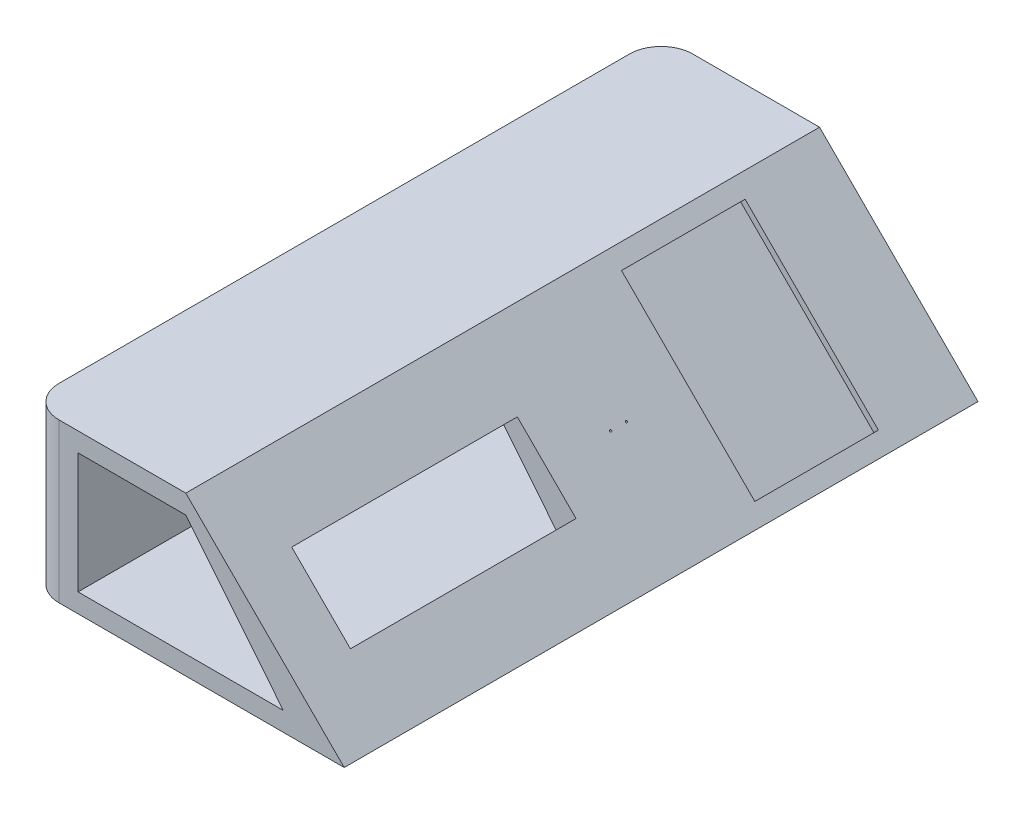
ISO-10303-21;
HEADER;
FILE_DESCRIPTION(('STEP AP214'),'2;1');
FILE_NAME('part.step','',(''),(''),'','','');
FILE_SCHEMA(('AUTOMOTIVE_DESIGN { 1 0 10303 214 1 1 1 1 }'));
ENDSEC;
DATA;
#1=APPLICATION_CONTEXT('core data for automotive mechanical design processes');
#2=APPLICATION_PROTOCOL_DEFINITION('international standard','automotive_design',2000,#1);
#3=PRODUCT_CONTEXT('',#1,'mechanical');
#4=PRODUCT('Part','Part','',(#3));
#5=PRODUCT_RELATED_PRODUCT_CATEGORY('part','',(#4));
#6=PRODUCT_DEFINITION_FORMATION('','',#4);
#7=PRODUCT_DEFINITION_CONTEXT('part definition',#1,'design');
#8=PRODUCT_DEFINITION('design','',#6,#7);
#9=PRODUCT_DEFINITION_SHAPE('','',#8);
#10=(LENGTH_UNIT() NAMED_UNIT(*) SI_UNIT(.MILLI.,.METRE.));
#11=(NAMED_UNIT(*) PLANE_ANGLE_UNIT() SI_UNIT($,.RADIAN.));
#12=(NAMED_UNIT(*) SI_UNIT($,.STERADIAN.) SOLID_ANGLE_UNIT());
#13=UNCERTAINTY_MEASURE_WITH_UNIT(LENGTH_MEASURE(1.E-05),#10,'distance_accuracy_value','');
#14=(GEOMETRIC_REPRESENTATION_CONTEXT(3) GLOBAL_UNCERTAINTY_ASSIGNED_CONTEXT((#13)) GLOBAL_UNIT_ASSIGNED_CONTEXT((#10,
#11,#12)) REPRESENTATION_CONTEXT('',''));
#15=CARTESIAN_POINT('',(0.,0.,0.));
#16=DIRECTION('',(0.,0.,1.));
#17=DIRECTION('',(1.,0.,0.));
#18=AXIS2_PLACEMENT_3D('',#15,#16,#17);
#19=CARTESIAN_POINT('',(0.,0.,200.));
#20=DIRECTION('',(1.,0.,0.));
#21=DIRECTION('',(0.,0.,-1.));
#22=AXIS2_PLACEMENT_3D('',#19,#20,#21);
#23=PLANE('',#22);
#24=DIRECTION('',(0.,0.,-1.));
#25=VECTOR('',#24,1.);
#26=CARTESIAN_POINT('',(0.,50.0000000000002,200.));
#27=LINE('',#26,#25);
#28=CARTESIAN_POINT('',(0.,50.0000000000002,190.));
#29=VERTEX_POINT('',#28);
#30=CARTESIAN_POINT('',(0.,50.0000000000002,10.));
#31=VERTEX_POINT('',#30);
#32=EDGE_CURVE('E307',#29,#31,#27,.T.);
#33=ORIENTED_EDGE('',*,*,#32,.T.);
#34=DIRECTION('',(0.,-1.,0.));
#35=VECTOR('',#34,1.);
#36=CARTESIAN_POINT('',(0.,0.,10.));
#37=LINE('',#36,#35);
#38=CARTESIAN_POINT('',(0.,0.,10.));
#39=VERTEX_POINT('',#38);
#40=EDGE_CURVE('E334',#31,#39,#37,.T.);
#41=ORIENTED_EDGE('',*,*,#40,.T.);
#42=DIRECTION('',(0.,0.,-1.));
#43=VECTOR('',#42,1.);
#44=CARTESIAN_POINT('',(0.,0.,200.));
#45=LINE('',#44,#43);
#46=CARTESIAN_POINT('',(0.,0.,190.));
#47=VERTEX_POINT('',#46);
#48=EDGE_CURVE('E327',#47,#39,#45,.T.);
#49=ORIENTED_EDGE('',*,*,#48,.F.);
#50=DIRECTION('',(0.,-1.,0.));
#51=VECTOR('',#50,1.);
#52=CARTESIAN_POINT('',(0.,0.,190.));
#53=LINE('',#52,#51);
#54=EDGE_CURVE('E331',#47,#29,#53,.F.);
#55=ORIENTED_EDGE('',*,*,#54,.T.);
#56=EDGE_LOOP('',(#33,#41,#49,#55));
#57=FACE_BOUND('',#56,.T.);
#58=ADVANCED_FACE('F48',(#57),#23,.F.);
#59=CARTESIAN_POINT('',(0.,0.,200.));
#60=DIRECTION('',(0.,1.,0.));
#61=DIRECTION('',(0.,0.,1.));
#62=AXIS2_PLACEMENT_3D('',#59,#60,#61);
#63=PLANE('',#62);
#64=ORIENTED_EDGE('',*,*,#48,.T.);
#65=CARTESIAN_POINT('',(10.,0.,10.));
#66=DIRECTION('',(0.,1.,0.));
#67=DIRECTION('',(0.,0.,1.));
#68=AXIS2_PLACEMENT_3D('',#65,#66,#67);
#69=CIRCLE('',#68,10.);
#70=CARTESIAN_POINT('',(10.,0.,0.));
#71=VERTEX_POINT('',#70);
#72=EDGE_CURVE('E341',#39,#71,#69,.F.);
#73=ORIENTED_EDGE('',*,*,#72,.T.);
#74=DIRECTION('',(1.,0.,0.));
#75=VECTOR('',#74,1.);
#76=CARTESIAN_POINT('',(0.,0.,0.));
#77=LINE('',#76,#75);
#78=CARTESIAN_POINT('',(100.,0.,0.));
#79=VERTEX_POINT('',#78);
#80=EDGE_CURVE('E286',#71,#79,#77,.T.);
#81=ORIENTED_EDGE('',*,*,#80,.T.);
#82=DIRECTION('',(0.,0.,-1.));
#83=VECTOR('',#82,1.);
#84=CARTESIAN_POINT('',(100.,0.,200.));
#85=LINE('',#84,#83);
#86=CARTESIAN_POINT('',(100.,0.,200.));
#87=VERTEX_POINT('',#86);
#88=EDGE_CURVE('E323',#87,#79,#85,.T.);
#89=ORIENTED_EDGE('',*,*,#88,.F.);
#90=DIRECTION('',(1.,0.,0.));
#91=VECTOR('',#90,1.);
#92=CARTESIAN_POINT('',(0.,0.,200.));
#93=LINE('',#92,#91);
#94=CARTESIAN_POINT('',(10.,0.,200.));
#95=VERTEX_POINT('',#94);
#96=EDGE_CURVE('E296',#95,#87,#93,.T.);
#97=ORIENTED_EDGE('',*,*,#96,.F.);
#98=CARTESIAN_POINT('',(10.,0.,190.));
#99=DIRECTION('',(0.,1.,0.));
#100=DIRECTION('',(0.,0.,1.));
#101=AXIS2_PLACEMENT_3D('',#98,#99,#100);
#102=CIRCLE('',#101,10.);
#103=EDGE_CURVE('E338',#95,#47,#102,.F.);
#104=ORIENTED_EDGE('',*,*,#103,.T.);
#105=EDGE_LOOP('',(#64,#73,#81,#89,#97,#104));
#106=FACE_BOUND('',#105,.T.);
#107=ADVANCED_FACE('F507',(#106),#63,.F.);
#108=CARTESIAN_POINT('',(50.,50.0000000000002,200.));
#109=DIRECTION('',(-0.707106781186549,-0.707106781186546,0.));
#110=DIRECTION('',(0.707106781186546,-0.707106781186549,0.));
#111=AXIS2_PLACEMENT_3D('',#108,#109,#110);
#112=PLANE('',#111);
#113=CARTESIAN_POINT('',(75.,25.0000000000001,90.9366552980361));
#114=DIRECTION('',(0.707106781186549,0.707106781186546,0.));
#115=DIRECTION('',(-0.707106781186546,0.707106781186549,0.));
#116=AXIS2_PLACEMENT_3D('',#113,#114,#115);
#117=CIRCLE('',#116,0.299999999999999);
#118=CARTESIAN_POINT('',(74.7878679656441,25.2121320343561,90.9366552980361));
#119=VERTEX_POINT('',#118);
#120=EDGE_CURVE('E368',#119,#119,#117,.T.);
#121=ORIENTED_EDGE('',*,*,#120,.F.);
#122=EDGE_LOOP('',(#121));
#123=FACE_BOUND('',#122,.T.);
#124=CARTESIAN_POINT('',(75.,25.0000000000001,85.9366552980361));
#125=DIRECTION('',(0.707106781186549,0.707106781186546,0.));
#126=DIRECTION('',(0.707106781186546,-0.707106781186549,0.));
#127=AXIS2_PLACEMENT_3D('',#124,#125,#126);
#128=CIRCLE('',#127,0.299999999999999);
#129=CARTESIAN_POINT('',(75.212132034356,24.7878679656441,85.9366552980361));
#130=VERTEX_POINT('',#129);
#131=EDGE_CURVE('E376',#130,#130,#128,.T.);
#132=ORIENTED_EDGE('',*,*,#131,.F.);
#133=EDGE_LOOP('',(#132));
#134=FACE_BOUND('',#133,.T.);
#135=DIRECTION('',(0.,0.,1.));
#136=VECTOR('',#135,1.);
#137=CARTESIAN_POINT('',(65.7369011664563,34.2630988335439,182.311084233199));
#138=LINE('',#137,#136);
#139=CARTESIAN_POINT('',(65.7369011664563,34.2630988335439,111.111084233199));
#140=VERTEX_POINT('',#139);
#141=CARTESIAN_POINT('',(65.7369011664563,34.2630988335439,182.311084233199));
#142=VERTEX_POINT('',#141);
#143=EDGE_CURVE('E229',#140,#142,#138,.T.);
#144=ORIENTED_EDGE('',*,*,#143,.F.);
#145=DIRECTION('',(-0.707106781186546,0.707106781186549,0.));
#146=VECTOR('',#145,1.);
#147=CARTESIAN_POINT('',(65.7369011664563,34.2630988335439,111.111084233199));
#148=LINE('',#147,#146);
#149=CARTESIAN_POINT('',(84.2630988335438,15.7369011664563,111.111084233199));
#150=VERTEX_POINT('',#149);
#151=EDGE_CURVE('E225',#150,#140,#148,.T.);
#152=ORIENTED_EDGE('',*,*,#151,.F.);
#153=DIRECTION('',(0.,0.,-1.));
#154=VECTOR('',#153,1.);
#155=CARTESIAN_POINT('',(84.2630988335438,15.7369011664563,182.311084233199));
#156=LINE('',#155,#154);
#157=CARTESIAN_POINT('',(84.2630988335438,15.7369011664563,182.311084233199));
#158=VERTEX_POINT('',#157);
#159=EDGE_CURVE('E237',#158,#150,#156,.T.);
#160=ORIENTED_EDGE('',*,*,#159,.F.);
#161=DIRECTION('',(0.707106781186546,-0.707106781186549,0.));
#162=VECTOR('',#161,1.);
#163=CARTESIAN_POINT('',(65.7369011664563,34.2630988335439,182.311084233199));
#164=LINE('',#163,#162);
#165=EDGE_CURVE('E233',#142,#158,#164,.T.);
#166=ORIENTED_EDGE('',*,*,#165,.F.);
#167=EDGE_LOOP('',(#144,#152,#160,#166));
#168=FACE_BOUND('',#167,.T.);
#169=DIRECTION('',(0.,0.,-1.));
#170=VECTOR('',#169,1.);
#171=CARTESIAN_POINT('',(96.0364267402998,3.96357325970027,66.4622855669242));
#172=LINE('',#171,#170);
#173=CARTESIAN_POINT('',(96.0364267402998,3.96357325970025,66.4622855669242));
#174=VERTEX_POINT('',#173);
#175=CARTESIAN_POINT('',(96.0364267402998,3.96357325970027,27.4622855669242));
#176=VERTEX_POINT('',#175);
#177=EDGE_CURVE('E272',#174,#176,#172,.T.);
#178=ORIENTED_EDGE('',*,*,#177,.F.);
#179=DIRECTION('',(0.707106781186546,-0.707106781186549,0.));
#180=VECTOR('',#179,1.);
#181=CARTESIAN_POINT('',(53.9635732597003,46.0364267402999,66.4622855669242));
#182=LINE('',#181,#180);
#183=CARTESIAN_POINT('',(53.9635732597003,46.0364267402999,66.4622855669242));
#184=VERTEX_POINT('',#183);
#185=EDGE_CURVE('E245',#184,#174,#182,.T.);
#186=ORIENTED_EDGE('',*,*,#185,.F.);
#187=DIRECTION('',(0.,0.,-1.));
#188=VECTOR('',#187,1.);
#189=CARTESIAN_POINT('',(53.9635732597003,46.0364267402999,66.4622855669242));
#190=LINE('',#189,#188);
#191=CARTESIAN_POINT('',(53.9635732597003,46.0364267402999,27.4622855669242));
#192=VERTEX_POINT('',#191);
#193=EDGE_CURVE('E259',#184,#192,#190,.T.);
#194=ORIENTED_EDGE('',*,*,#193,.T.);
#195=DIRECTION('',(0.707106781186546,-0.707106781186549,0.));
#196=VECTOR('',#195,1.);
#197=CARTESIAN_POINT('',(53.9635732597003,46.0364267402999,27.4622855669242));
#198=LINE('',#197,#196);
#199=EDGE_CURVE('E276',#192,#176,#198,.T.);
#200=ORIENTED_EDGE('',*,*,#199,.T.);
#201=EDGE_LOOP('',(#178,#186,#194,#200));
#202=FACE_BOUND('',#201,.T.);
#203=DIRECTION('',(-0.707106781186546,0.707106781186549,0.));
#204=VECTOR('',#203,1.);
#205=CARTESIAN_POINT('',(50.,50.0000000000002,0.));
#206=LINE('',#205,#204);
#207=CARTESIAN_POINT('',(50.,50.0000000000002,0.));
#208=VERTEX_POINT('',#207);
#209=EDGE_CURVE('E310',#79,#208,#206,.T.);
#210=ORIENTED_EDGE('',*,*,#209,.T.);
#211=DIRECTION('',(0.,0.,-1.));
#212=VECTOR('',#211,1.);
#213=CARTESIAN_POINT('',(50.,50.0000000000002,200.));
#214=LINE('',#213,#212);
#215=CARTESIAN_POINT('',(50.,50.0000000000002,200.));
#216=VERTEX_POINT('',#215);
#217=EDGE_CURVE('E319',#216,#208,#214,.T.);
#218=ORIENTED_EDGE('',*,*,#217,.F.);
#219=DIRECTION('',(-0.707106781186546,0.707106781186549,0.));
#220=VECTOR('',#219,1.);
#221=CARTESIAN_POINT('',(50.,50.0000000000002,200.));
#222=LINE('',#221,#220);
#223=EDGE_CURVE('E299',#87,#216,#222,.T.);
#224=ORIENTED_EDGE('',*,*,#223,.F.);
#225=ORIENTED_EDGE('',*,*,#88,.T.);
#226=EDGE_LOOP('',(#210,#218,#224,#225));
#227=FACE_BOUND('',#226,.T.);
#228=ADVANCED_FACE('F503',(#123,#134,#168,#202,#227),#112,.F.);
#229=CARTESIAN_POINT('',(0.,50.0000000000002,200.));
#230=DIRECTION('',(0.,-1.,0.));
#231=DIRECTION('',(0.,0.,-1.));
#232=AXIS2_PLACEMENT_3D('',#229,#230,#231);
#233=PLANE('',#232);
#234=DIRECTION('',(-1.,0.,0.));
#235=VECTOR('',#234,1.);
#236=CARTESIAN_POINT('',(0.,50.0000000000002,0.));
#237=LINE('',#236,#235);
#238=CARTESIAN_POINT('',(10.,50.0000000000002,0.));
#239=VERTEX_POINT('',#238);
#240=EDGE_CURVE('E300',#208,#239,#237,.T.);
#241=ORIENTED_EDGE('',*,*,#240,.T.);
#242=CARTESIAN_POINT('',(10.,50.0000000000002,10.));
#243=DIRECTION('',(0.,-1.,0.));
#244=DIRECTION('',(0.,0.,-1.));
#245=AXIS2_PLACEMENT_3D('',#242,#243,#244);
#246=CIRCLE('',#245,10.);
#247=EDGE_CURVE('E350',#239,#31,#246,.F.);
#248=ORIENTED_EDGE('',*,*,#247,.T.);
#249=ORIENTED_EDGE('',*,*,#32,.F.);
#250=CARTESIAN_POINT('',(10.,50.0000000000002,190.));
#251=DIRECTION('',(0.,-1.,0.));
#252=DIRECTION('',(0.,0.,-1.));
#253=AXIS2_PLACEMENT_3D('',#250,#251,#252);
#254=CIRCLE('',#253,10.);
#255=CARTESIAN_POINT('',(10.,50.0000000000002,200.));
#256=VERTEX_POINT('',#255);
#257=EDGE_CURVE('E347',#29,#256,#254,.F.);
#258=ORIENTED_EDGE('',*,*,#257,.T.);
#259=DIRECTION('',(-1.,0.,0.));
#260=VECTOR('',#259,1.);
#261=CARTESIAN_POINT('',(0.,50.0000000000002,200.));
#262=LINE('',#261,#260);
#263=EDGE_CURVE('E303',#216,#256,#262,.T.);
#264=ORIENTED_EDGE('',*,*,#263,.F.);
#265=ORIENTED_EDGE('',*,*,#217,.T.);
#266=EDGE_LOOP('',(#241,#248,#249,#258,#264,#265));
#267=FACE_BOUND('',#266,.T.);
#268=ADVANCED_FACE('F506',(#267),#233,.F.);
#269=CARTESIAN_POINT('',(0.,0.,200.));
#270=DIRECTION('',(0.,0.,-1.));
#271=DIRECTION('',(-1.,0.,0.));
#272=AXIS2_PLACEMENT_3D('',#269,#270,#271);
#273=PLANE('',#272);
#274=DIRECTION('',(0.,-1.,0.));
#275=VECTOR('',#274,1.);
#276=CARTESIAN_POINT('',(16.,5.99999999999999,200.));
#277=LINE('',#276,#275);
#278=CARTESIAN_POINT('',(16.,44.0000000000002,200.));
#279=VERTEX_POINT('',#278);
#280=CARTESIAN_POINT('',(16.,5.99999999999999,200.));
#281=VERTEX_POINT('',#280);
#282=EDGE_CURVE('E187',#279,#281,#277,.T.);
#283=ORIENTED_EDGE('',*,*,#282,.F.);
#284=DIRECTION('',(-1.,0.,0.));
#285=VECTOR('',#284,1.);
#286=CARTESIAN_POINT('',(16.,44.0000000000002,200.));
#287=LINE('',#286,#285);
#288=CARTESIAN_POINT('',(50.,44.0000000000002,200.));
#289=VERTEX_POINT('',#288);
#290=EDGE_CURVE('E66',#289,#279,#287,.T.);
#291=ORIENTED_EDGE('',*,*,#290,.F.);
#292=DIRECTION('',(-0.629320391049843,0.777145961456966,0.));
#293=VECTOR('',#292,1.);
#294=CARTESIAN_POINT('',(50.,44.0000000000002,200.));
#295=LINE('',#294,#293);
#296=CARTESIAN_POINT('',(80.7717932614109,6.,200.));
#297=VERTEX_POINT('',#296);
#298=EDGE_CURVE('E195',#297,#289,#295,.T.);
#299=ORIENTED_EDGE('',*,*,#298,.F.);
#300=DIRECTION('',(1.,0.,0.));
#301=VECTOR('',#300,1.);
#302=CARTESIAN_POINT('',(80.7717932614109,6.,200.));
#303=LINE('',#302,#301);
#304=EDGE_CURVE('E178',#281,#297,#303,.T.);
#305=ORIENTED_EDGE('',*,*,#304,.F.);
#306=EDGE_LOOP('',(#283,#291,#299,#305));
#307=FACE_BOUND('',#306,.T.);
#308=ORIENTED_EDGE('',*,*,#263,.T.);
#309=DIRECTION('',(0.,-1.,0.));
#310=VECTOR('',#309,1.);
#311=CARTESIAN_POINT('',(10.,0.,200.));
#312=LINE('',#311,#310);
#313=EDGE_CURVE('E353',#256,#95,#312,.T.);
#314=ORIENTED_EDGE('',*,*,#313,.T.);
#315=ORIENTED_EDGE('',*,*,#96,.T.);
#316=ORIENTED_EDGE('',*,*,#223,.T.);
#317=EDGE_LOOP('',(#308,#314,#315,#316));
#318=FACE_BOUND('',#317,.T.);
#319=ADVANCED_FACE('F192',(#307,#318),#273,.F.);
#320=CARTESIAN_POINT('',(0.,0.,0.));
#321=DIRECTION('',(0.,0.,-1.));
#322=DIRECTION('',(-1.,0.,0.));
#323=AXIS2_PLACEMENT_3D('',#320,#321,#322);
#324=PLANE('',#323);
#325=DIRECTION('',(1.,0.,0.));
#326=VECTOR('',#325,1.);
#327=CARTESIAN_POINT('',(0.,44.0000000000002,0.));
#328=LINE('',#327,#326);
#329=CARTESIAN_POINT('',(16.,44.0000000000002,0.));
#330=VERTEX_POINT('',#329);
#331=CARTESIAN_POINT('',(50.,44.0000000000002,0.));
#332=VERTEX_POINT('',#331);
#333=EDGE_CURVE('E11',#330,#332,#328,.T.);
#334=ORIENTED_EDGE('',*,*,#333,.F.);
#335=DIRECTION('',(0.,1.,0.));
#336=VECTOR('',#335,1.);
#337=CARTESIAN_POINT('',(16.,0.,0.));
#338=LINE('',#337,#336);
#339=CARTESIAN_POINT('',(16.,5.99999999999999,0.));
#340=VERTEX_POINT('',#339);
#341=EDGE_CURVE('E361',#340,#330,#338,.T.);
#342=ORIENTED_EDGE('',*,*,#341,.F.);
#343=DIRECTION('',(-1.,0.,0.));
#344=VECTOR('',#343,1.);
#345=CARTESIAN_POINT('',(0.,5.99999999999999,0.));
#346=LINE('',#345,#344);
#347=CARTESIAN_POINT('',(80.7717932614109,6.,0.));
#348=VERTEX_POINT('',#347);
#349=EDGE_CURVE('E58',#348,#340,#346,.T.);
#350=ORIENTED_EDGE('',*,*,#349,.F.);
#351=DIRECTION('',(0.629320391049843,-0.777145961456966,0.));
#352=VECTOR('',#351,1.);
#353=CARTESIAN_POINT('',(51.7170394865875,41.8796328203549,0.));
#354=LINE('',#353,#352);
#355=EDGE_CURVE('E222',#332,#348,#354,.T.);
#356=ORIENTED_EDGE('',*,*,#355,.F.);
#357=EDGE_LOOP('',(#334,#342,#350,#356));
#358=FACE_BOUND('',#357,.T.);
#359=ORIENTED_EDGE('',*,*,#80,.F.);
#360=DIRECTION('',(0.,-1.,0.));
#361=VECTOR('',#360,1.);
#362=CARTESIAN_POINT('',(10.,50.0000000000002,0.));
#363=LINE('',#362,#361);
#364=EDGE_CURVE('E344',#71,#239,#363,.F.);
#365=ORIENTED_EDGE('',*,*,#364,.T.);
#366=ORIENTED_EDGE('',*,*,#240,.F.);
#367=ORIENTED_EDGE('',*,*,#209,.F.);
#368=EDGE_LOOP('',(#359,#365,#366,#367));
#369=FACE_BOUND('',#368,.T.);
#370=ADVANCED_FACE('F527',(#358,#369),#324,.T.);
#371=CARTESIAN_POINT('',(10.,0.,10.));
#372=DIRECTION('',(0.,1.,0.));
#373=DIRECTION('',(0.,0.,1.));
#374=AXIS2_PLACEMENT_3D('',#371,#372,#373);
#375=CYLINDRICAL_SURFACE('',#374,10.);
#376=ORIENTED_EDGE('',*,*,#247,.F.);
#377=ORIENTED_EDGE('',*,*,#364,.F.);
#378=ORIENTED_EDGE('',*,*,#72,.F.);
#379=ORIENTED_EDGE('',*,*,#40,.F.);
#380=EDGE_LOOP('',(#376,#377,#378,#379));
#381=FACE_BOUND('',#380,.T.);
#382=ADVANCED_FACE('F530',(#381),#375,.T.);
#383=CARTESIAN_POINT('',(10.,0.,190.));
#384=DIRECTION('',(0.,-1.,0.));
#385=DIRECTION('',(0.,0.,-1.));
#386=AXIS2_PLACEMENT_3D('',#383,#384,#385);
#387=CYLINDRICAL_SURFACE('',#386,10.);
#388=ORIENTED_EDGE('',*,*,#257,.F.);
#389=ORIENTED_EDGE('',*,*,#54,.F.);
#390=ORIENTED_EDGE('',*,*,#103,.F.);
#391=ORIENTED_EDGE('',*,*,#313,.F.);
#392=EDGE_LOOP('',(#388,#389,#390,#391));
#393=FACE_BOUND('',#392,.T.);
#394=ADVANCED_FACE('F50',(#393),#387,.T.);
#395=CARTESIAN_POINT('',(52.5493596973272,44.6222131779268,66.4622855669242));
#396=DIRECTION('',(0.,0.,1.));
#397=DIRECTION('',(0.,-1.,0.));
#398=AXIS2_PLACEMENT_3D('',#395,#396,#397);
#399=PLANE('',#398);
#400=ORIENTED_EDGE('',*,*,#185,.T.);
#401=DIRECTION('',(0.707106781186549,0.707106781186546,0.));
#402=VECTOR('',#401,1.);
#403=CARTESIAN_POINT('',(94.6222131779267,2.54935969732718,66.4622855669242));
#404=LINE('',#403,#402);
#405=CARTESIAN_POINT('',(94.6222131779267,2.54935969732718,66.4622855669242));
#406=VERTEX_POINT('',#405);
#407=EDGE_CURVE('E269',#406,#174,#404,.T.);
#408=ORIENTED_EDGE('',*,*,#407,.F.);
#409=DIRECTION('',(0.707106781186546,-0.707106781186549,0.));
#410=VECTOR('',#409,1.);
#411=CARTESIAN_POINT('',(52.5493596973272,44.6222131779268,66.4622855669242));
#412=LINE('',#411,#410);
#413=CARTESIAN_POINT('',(52.5493596973272,44.6222131779268,66.4622855669242));
#414=VERTEX_POINT('',#413);
#415=EDGE_CURVE('E254',#414,#406,#412,.T.);
#416=ORIENTED_EDGE('',*,*,#415,.F.);
#417=DIRECTION('',(0.707106781186549,0.707106781186546,0.));
#418=VECTOR('',#417,1.);
#419=CARTESIAN_POINT('',(52.5493596973272,44.6222131779268,66.4622855669242));
#420=LINE('',#419,#418);
#421=EDGE_CURVE('E283',#414,#184,#420,.T.);
#422=ORIENTED_EDGE('',*,*,#421,.T.);
#423=EDGE_LOOP('',(#400,#408,#416,#422));
#424=FACE_BOUND('',#423,.T.);
#425=ADVANCED_FACE('F553',(#424),#399,.F.);
#426=CARTESIAN_POINT('',(52.5493596973272,44.6222131779268,66.4622855669242));
#427=DIRECTION('',(0.707106781186546,-0.707106781186549,0.));
#428=DIRECTION('',(0.707106781186549,0.707106781186546,0.));
#429=AXIS2_PLACEMENT_3D('',#426,#427,#428);
#430=PLANE('',#429);
#431=ORIENTED_EDGE('',*,*,#193,.F.);
#432=ORIENTED_EDGE('',*,*,#421,.F.);
#433=DIRECTION('',(0.,0.,-1.));
#434=VECTOR('',#433,1.);
#435=CARTESIAN_POINT('',(52.5493596973272,44.6222131779268,66.4622855669242));
#436=LINE('',#435,#434);
#437=CARTESIAN_POINT('',(52.5493596973272,44.6222131779268,27.4622855669242));
#438=VERTEX_POINT('',#437);
#439=EDGE_CURVE('E266',#414,#438,#436,.T.);
#440=ORIENTED_EDGE('',*,*,#439,.T.);
#441=DIRECTION('',(0.707106781186549,0.707106781186546,0.));
#442=VECTOR('',#441,1.);
#443=CARTESIAN_POINT('',(52.5493596973272,44.6222131779268,27.4622855669242));
#444=LINE('',#443,#442);
#445=EDGE_CURVE('E287',#438,#192,#444,.T.);
#446=ORIENTED_EDGE('',*,*,#445,.T.);
#447=EDGE_LOOP('',(#431,#432,#440,#446));
#448=FACE_BOUND('',#447,.T.);
#449=ADVANCED_FACE('F596',(#448),#430,.T.);
#450=CARTESIAN_POINT('',(52.5493596973272,44.6222131779268,27.4622855669242));
#451=DIRECTION('',(0.,0.,1.));
#452=DIRECTION('',(0.,-1.,0.));
#453=AXIS2_PLACEMENT_3D('',#450,#451,#452);
#454=PLANE('',#453);
#455=ORIENTED_EDGE('',*,*,#199,.F.);
#456=ORIENTED_EDGE('',*,*,#445,.F.);
#457=DIRECTION('',(0.707106781186546,-0.707106781186549,0.));
#458=VECTOR('',#457,1.);
#459=CARTESIAN_POINT('',(52.5493596973272,44.6222131779268,27.4622855669242));
#460=LINE('',#459,#458);
#461=CARTESIAN_POINT('',(94.6222131779267,2.54935969732718,27.4622855669242));
#462=VERTEX_POINT('',#461);
#463=EDGE_CURVE('E263',#438,#462,#460,.T.);
#464=ORIENTED_EDGE('',*,*,#463,.T.);
#465=DIRECTION('',(0.707106781186549,0.707106781186546,0.));
#466=VECTOR('',#465,1.);
#467=CARTESIAN_POINT('',(94.6222131779267,2.54935969732718,27.4622855669242));
#468=LINE('',#467,#466);
#469=EDGE_CURVE('E290',#462,#176,#468,.T.);
#470=ORIENTED_EDGE('',*,*,#469,.T.);
#471=EDGE_LOOP('',(#455,#456,#464,#470));
#472=FACE_BOUND('',#471,.T.);
#473=ADVANCED_FACE('F605',(#472),#454,.T.);
#474=CARTESIAN_POINT('',(94.6222131779267,2.54935969732718,66.4622855669242));
#475=DIRECTION('',(0.707106781186546,-0.707106781186549,0.));
#476=DIRECTION('',(0.707106781186549,0.707106781186546,0.));
#477=AXIS2_PLACEMENT_3D('',#474,#475,#476);
#478=PLANE('',#477);
#479=ORIENTED_EDGE('',*,*,#177,.T.);
#480=ORIENTED_EDGE('',*,*,#469,.F.);
#481=DIRECTION('',(0.,0.,-1.));
#482=VECTOR('',#481,1.);
#483=CARTESIAN_POINT('',(94.6222131779267,2.54935969732718,66.4622855669242));
#484=LINE('',#483,#482);
#485=EDGE_CURVE('E258',#406,#462,#484,.T.);
#486=ORIENTED_EDGE('',*,*,#485,.F.);
#487=ORIENTED_EDGE('',*,*,#407,.T.);
#488=EDGE_LOOP('',(#479,#480,#486,#487));
#489=FACE_BOUND('',#488,.T.);
#490=ADVANCED_FACE('F615',(#489),#478,.F.);
#491=CARTESIAN_POINT('',(48.5857864376271,48.5857864376269,0.));
#492=DIRECTION('',(0.707106781186549,0.707106781186546,0.));
#493=DIRECTION('',(-0.707106781186546,0.707106781186549,0.));
#494=AXIS2_PLACEMENT_3D('',#491,#492,#493);
#495=PLANE('',#494);
#496=ORIENTED_EDGE('',*,*,#415,.T.);
#497=ORIENTED_EDGE('',*,*,#485,.T.);
#498=ORIENTED_EDGE('',*,*,#463,.F.);
#499=ORIENTED_EDGE('',*,*,#439,.F.);
#500=EDGE_LOOP('',(#496,#497,#498,#499));
#501=FACE_BOUND('',#500,.T.);
#502=ADVANCED_FACE('F625',(#501),#495,.T.);
#503=CARTESIAN_POINT('',(58.6658333545908,27.1920310216784,111.111084233199));
#504=DIRECTION('',(0.,0.,-1.));
#505=DIRECTION('',(-1.,0.,0.));
#506=AXIS2_PLACEMENT_3D('',#503,#504,#505);
#507=PLANE('',#506);
#508=DIRECTION('',(0.707106781186549,0.707106781186546,0.));
#509=VECTOR('',#508,1.);
#510=CARTESIAN_POINT('',(58.6658333545908,27.1920310216784,111.111084233199));
#511=LINE('',#510,#509);
#512=CARTESIAN_POINT('',(61.3981989097015,29.9243965767891,111.111084233199));
#513=VERTEX_POINT('',#512);
#514=EDGE_CURVE('E241',#513,#140,#511,.T.);
#515=ORIENTED_EDGE('',*,*,#514,.F.);
#516=DIRECTION('',(0.629320391049843,-0.777145961456966,0.));
#517=VECTOR('',#516,1.);
#518=CARTESIAN_POINT('',(61.6523899094234,29.6104968340157,111.111084233199));
#519=LINE('',#518,#517);
#520=CARTESIAN_POINT('',(77.9772147386092,9.45101707152168,111.111084233199));
#521=VERTEX_POINT('',#520);
#522=EDGE_CURVE('E218',#513,#521,#519,.T.);
#523=ORIENTED_EDGE('',*,*,#522,.T.);
#524=DIRECTION('',(0.707106781186549,0.707106781186546,0.));
#525=VECTOR('',#524,1.);
#526=CARTESIAN_POINT('',(77.1920310216783,8.66583335459083,111.111084233199));
#527=LINE('',#526,#525);
#528=EDGE_CURVE('E242',#521,#150,#527,.T.);
#529=ORIENTED_EDGE('',*,*,#528,.T.);
#530=ORIENTED_EDGE('',*,*,#151,.T.);
#531=EDGE_LOOP('',(#515,#523,#529,#530));
#532=FACE_BOUND('',#531,.T.);
#533=ADVANCED_FACE('F634',(#532),#507,.F.);
#534=CARTESIAN_POINT('',(77.1920310216783,8.66583335459083,182.311084233199));
#535=DIRECTION('',(0.707106781186546,-0.707106781186549,0.));
#536=DIRECTION('',(0.707106781186549,0.707106781186546,0.));
#537=AXIS2_PLACEMENT_3D('',#534,#535,#536);
#538=PLANE('',#537);
#539=ORIENTED_EDGE('',*,*,#528,.F.);
#540=DIRECTION('',(0.,0.,1.));
#541=VECTOR('',#540,1.);
#542=CARTESIAN_POINT('',(77.9772147386092,9.45101707152168,182.311084233199));
#543=LINE('',#542,#541);
#544=CARTESIAN_POINT('',(77.9772147386092,9.45101707152168,182.311084233199));
#545=VERTEX_POINT('',#544);
#546=EDGE_CURVE('E214',#521,#545,#543,.T.);
#547=ORIENTED_EDGE('',*,*,#546,.T.);
#548=DIRECTION('',(0.707106781186549,0.707106781186546,0.));
#549=VECTOR('',#548,1.);
#550=CARTESIAN_POINT('',(77.1920310216783,8.66583335459083,182.311084233199));
#551=LINE('',#550,#549);
#552=EDGE_CURVE('E246',#545,#158,#551,.T.);
#553=ORIENTED_EDGE('',*,*,#552,.T.);
#554=ORIENTED_EDGE('',*,*,#159,.T.);
#555=EDGE_LOOP('',(#539,#547,#553,#554));
#556=FACE_BOUND('',#555,.T.);
#557=ADVANCED_FACE('F643',(#556),#538,.F.);
#558=CARTESIAN_POINT('',(58.6658333545908,27.1920310216784,182.311084233199));
#559=DIRECTION('',(0.,0.,1.));
#560=DIRECTION('',(1.,0.,0.));
#561=AXIS2_PLACEMENT_3D('',#558,#559,#560);
#562=PLANE('',#561);
#563=ORIENTED_EDGE('',*,*,#552,.F.);
#564=DIRECTION('',(-0.629320391049843,0.777145961456966,0.));
#565=VECTOR('',#564,1.);
#566=CARTESIAN_POINT('',(61.6523899094234,29.6104968340157,182.311084233199));
#567=LINE('',#566,#565);
#568=CARTESIAN_POINT('',(61.3981989097015,29.9243965767891,182.311084233199));
#569=VERTEX_POINT('',#568);
#570=EDGE_CURVE('E206',#545,#569,#567,.T.);
#571=ORIENTED_EDGE('',*,*,#570,.T.);
#572=DIRECTION('',(0.707106781186549,0.707106781186546,0.));
#573=VECTOR('',#572,1.);
#574=CARTESIAN_POINT('',(58.6658333545908,27.1920310216784,182.311084233199));
#575=LINE('',#574,#573);
#576=EDGE_CURVE('E249',#569,#142,#575,.T.);
#577=ORIENTED_EDGE('',*,*,#576,.T.);
#578=ORIENTED_EDGE('',*,*,#165,.T.);
#579=EDGE_LOOP('',(#563,#571,#577,#578));
#580=FACE_BOUND('',#579,.T.);
#581=ADVANCED_FACE('F653',(#580),#562,.F.);
#582=CARTESIAN_POINT('',(58.6658333545908,27.1920310216784,182.311084233199));
#583=DIRECTION('',(-0.707106781186546,0.707106781186549,0.));
#584=DIRECTION('',(-0.707106781186549,-0.707106781186546,0.));
#585=AXIS2_PLACEMENT_3D('',#582,#583,#584);
#586=PLANE('',#585);
#587=ORIENTED_EDGE('',*,*,#576,.F.);
#588=DIRECTION('',(0.,0.,-1.));
#589=VECTOR('',#588,1.);
#590=CARTESIAN_POINT('',(61.3981989097015,29.9243965767891,182.311084233199));
#591=LINE('',#590,#589);
#592=EDGE_CURVE('E357',#569,#513,#591,.T.);
#593=ORIENTED_EDGE('',*,*,#592,.T.);
#594=ORIENTED_EDGE('',*,*,#514,.T.);
#595=ORIENTED_EDGE('',*,*,#143,.T.);
#596=EDGE_LOOP('',(#587,#593,#594,#595));
#597=FACE_BOUND('',#596,.T.);
#598=ADVANCED_FACE('F663',(#597),#586,.F.);
#599=CARTESIAN_POINT('',(50.,44.0000000000002,-15.0000000000002));
#600=DIRECTION('',(0.777145961456966,0.629320391049843,0.));
#601=DIRECTION('',(-0.629320391049843,0.777145961456966,0.));
#602=AXIS2_PLACEMENT_3D('',#599,#600,#601);
#603=PLANE('',#602);
#604=CARTESIAN_POINT('',(69.6877068241553,19.6877068241554,90.9366552980361));
#605=DIRECTION('',(0.777145961456966,0.629320391049843,0.));
#606=DIRECTION('',(-0.629320391049843,0.777145961456966,0.));
#607=AXIS2_PLACEMENT_3D('',#604,#605,#606);
#608=ELLIPSE('',#607,0.301652483869053,0.299999999999999);
#609=CARTESIAN_POINT('',(69.4978707650457,19.9221348337577,90.9366552980361));
#610=VERTEX_POINT('',#609);
#611=EDGE_CURVE('E52',#610,#610,#608,.T.);
#612=ORIENTED_EDGE('',*,*,#611,.T.);
#613=EDGE_LOOP('',(#612));
#614=FACE_BOUND('',#613,.T.);
#615=CARTESIAN_POINT('',(69.6877068241553,19.6877068241554,85.9366552980361));
#616=DIRECTION('',(0.777145961456966,0.629320391049843,0.));
#617=DIRECTION('',(-0.629320391049843,0.777145961456966,0.));
#618=AXIS2_PLACEMENT_3D('',#615,#616,#617);
#619=ELLIPSE('',#618,0.301652483869053,0.299999999999999);
#620=CARTESIAN_POINT('',(69.4978707650457,19.9221348337577,85.9366552980361));
#621=VERTEX_POINT('',#620);
#622=EDGE_CURVE('E365',#621,#621,#619,.T.);
#623=ORIENTED_EDGE('',*,*,#622,.T.);
#624=EDGE_LOOP('',(#623));
#625=FACE_BOUND('',#624,.T.);
#626=ORIENTED_EDGE('',*,*,#355,.T.);
#627=DIRECTION('',(0.,0.,1.));
#628=VECTOR('',#627,1.);
#629=CARTESIAN_POINT('',(80.7717932614109,6.,-15.0000000000002));
#630=LINE('',#629,#628);
#631=EDGE_CURVE('E183',#348,#297,#630,.T.);
#632=ORIENTED_EDGE('',*,*,#631,.T.);
#633=ORIENTED_EDGE('',*,*,#298,.T.);
#634=DIRECTION('',(0.,0.,1.));
#635=VECTOR('',#634,1.);
#636=CARTESIAN_POINT('',(50.,44.0000000000002,-15.0000000000002));
#637=LINE('',#636,#635);
#638=EDGE_CURVE('E203',#332,#289,#637,.T.);
#639=ORIENTED_EDGE('',*,*,#638,.F.);
#640=EDGE_LOOP('',(#626,#632,#633,#639));
#641=FACE_BOUND('',#640,.T.);
#642=ORIENTED_EDGE('',*,*,#592,.F.);
#643=ORIENTED_EDGE('',*,*,#570,.F.);
#644=ORIENTED_EDGE('',*,*,#546,.F.);
#645=ORIENTED_EDGE('',*,*,#522,.F.);
#646=EDGE_LOOP('',(#642,#643,#644,#645));
#647=FACE_BOUND('',#646,.T.);
#648=ADVANCED_FACE('F673',(#614,#625,#641,#647),#603,.F.);
#649=CARTESIAN_POINT('',(16.,44.0000000000002,-15.0000000000002));
#650=DIRECTION('',(0.,1.,0.));
#651=DIRECTION('',(0.,0.,1.));
#652=AXIS2_PLACEMENT_3D('',#649,#650,#651);
#653=PLANE('',#652);
#654=ORIENTED_EDGE('',*,*,#333,.T.);
#655=ORIENTED_EDGE('',*,*,#638,.T.);
#656=ORIENTED_EDGE('',*,*,#290,.T.);
#657=DIRECTION('',(0.,0.,1.));
#658=VECTOR('',#657,1.);
#659=CARTESIAN_POINT('',(16.,44.0000000000002,-15.0000000000002));
#660=LINE('',#659,#658);
#661=EDGE_CURVE('E184',#330,#279,#660,.T.);
#662=ORIENTED_EDGE('',*,*,#661,.F.);
#663=EDGE_LOOP('',(#654,#655,#656,#662));
#664=FACE_BOUND('',#663,.T.);
#665=ADVANCED_FACE('F684',(#664),#653,.F.);
#666=CARTESIAN_POINT('',(80.7717932614109,6.,-15.0000000000002));
#667=DIRECTION('',(0.,-1.,0.));
#668=DIRECTION('',(1.,0.,0.));
#669=AXIS2_PLACEMENT_3D('',#666,#667,#668);
#670=PLANE('',#669);
#671=ORIENTED_EDGE('',*,*,#349,.T.);
#672=DIRECTION('',(0.,0.,1.));
#673=VECTOR('',#672,1.);
#674=CARTESIAN_POINT('',(16.,5.99999999999999,-15.0000000000002));
#675=LINE('',#674,#673);
#676=EDGE_CURVE('E74',#340,#281,#675,.T.);
#677=ORIENTED_EDGE('',*,*,#676,.T.);
#678=ORIENTED_EDGE('',*,*,#304,.T.);
#679=ORIENTED_EDGE('',*,*,#631,.F.);
#680=EDGE_LOOP('',(#671,#677,#678,#679));
#681=FACE_BOUND('',#680,.T.);
#682=ADVANCED_FACE('F175',(#681),#670,.F.);
#683=CARTESIAN_POINT('',(16.,5.99999999999999,-15.0000000000002));
#684=DIRECTION('',(-1.,0.,0.));
#685=DIRECTION('',(0.,0.,1.));
#686=AXIS2_PLACEMENT_3D('',#683,#684,#685);
#687=PLANE('',#686);
#688=ORIENTED_EDGE('',*,*,#341,.T.);
#689=ORIENTED_EDGE('',*,*,#661,.T.);
#690=ORIENTED_EDGE('',*,*,#282,.T.);
#691=ORIENTED_EDGE('',*,*,#676,.F.);
#692=EDGE_LOOP('',(#688,#689,#690,#691));
#693=FACE_BOUND('',#692,.T.);
#694=ADVANCED_FACE('F188',(#693),#687,.F.);
#695=CARTESIAN_POINT('',(67.9289321881345,17.9289321881346,85.9366552980361));
#696=DIRECTION('',(0.707106781186549,0.707106781186546,0.));
#697=DIRECTION('',(-0.707106781186546,0.707106781186549,0.));
#698=AXIS2_PLACEMENT_3D('',#695,#696,#697);
#699=CYLINDRICAL_SURFACE('',#698,0.299999999999999);
#700=ORIENTED_EDGE('',*,*,#131,.T.);
#701=EDGE_LOOP('',(#700));
#702=FACE_BOUND('',#701,.T.);
#703=ORIENTED_EDGE('',*,*,#622,.F.);
#704=EDGE_LOOP('',(#703));
#705=FACE_BOUND('',#704,.T.);
#706=ADVANCED_FACE('F500',(#702,#705),#699,.F.);
#707=CARTESIAN_POINT('',(67.9289321881345,17.9289321881346,90.9366552980361));
#708=DIRECTION('',(0.707106781186549,0.707106781186546,0.));
#709=DIRECTION('',(-0.707106781186546,0.707106781186549,0.));
#710=AXIS2_PLACEMENT_3D('',#707,#708,#709);
#711=CYLINDRICAL_SURFACE('',#710,0.299999999999999);
#712=ORIENTED_EDGE('',*,*,#120,.T.);
#713=EDGE_LOOP('',(#712));
#714=FACE_BOUND('',#713,.T.);
#715=ORIENTED_EDGE('',*,*,#611,.F.);
#716=EDGE_LOOP('',(#715));
#717=FACE_BOUND('',#716,.T.);
#718=ADVANCED_FACE('F718',(#714,#717),#711,.F.);
#719=CLOSED_SHELL('',(#58,#107,#228,#268,#319,#370,#382,#394,#425,#449,#473,#490,#502,#533,#557,
#581,#598,#648,#665,#682,#694,#706,#718));
#720=MANIFOLD_SOLID_BREP('B2',#719);
#721=ADVANCED_BREP_SHAPE_REPRESENTATION('',(#18,#720),#14);
#722=SHAPE_DEFINITION_REPRESENTATION(#9,#721);
ENDSEC;
END-ISO-10303-21;
